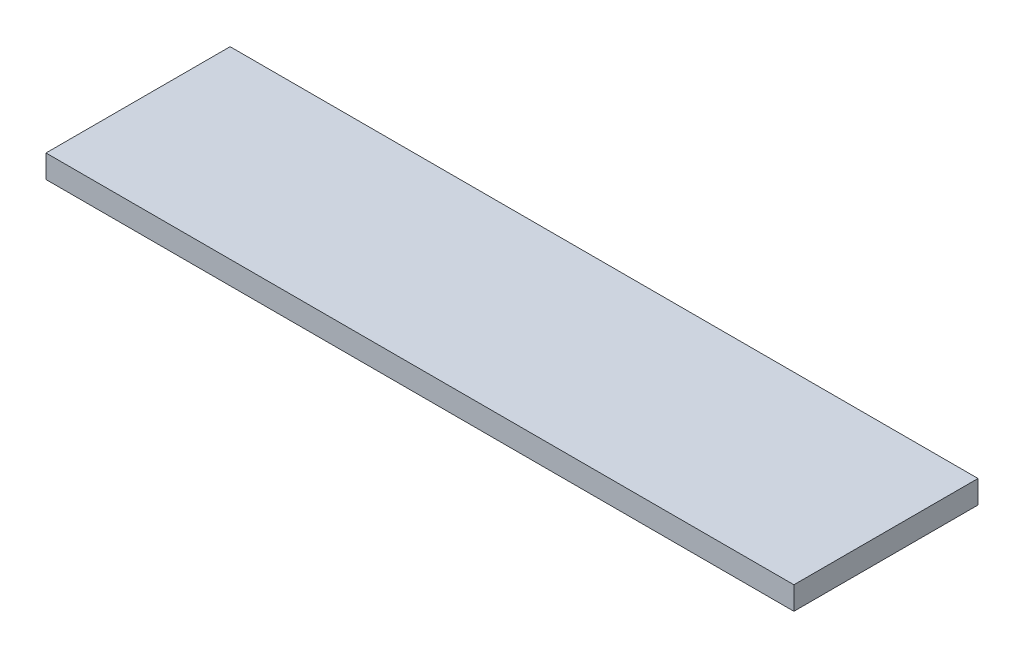
ISO-10303-21;
HEADER;
FILE_DESCRIPTION(('STEP AP214'),'2;1');
FILE_NAME('part.step','',(''),(''),'','','');
FILE_SCHEMA(('AUTOMOTIVE_DESIGN { 1 0 10303 214 1 1 1 1 }'));
ENDSEC;
DATA;
#1=APPLICATION_CONTEXT('core data for automotive mechanical design processes');
#2=APPLICATION_PROTOCOL_DEFINITION('international standard','automotive_design',2000,#1);
#3=PRODUCT_CONTEXT('',#1,'mechanical');
#4=PRODUCT('Part','Part','',(#3));
#5=PRODUCT_RELATED_PRODUCT_CATEGORY('part','',(#4));
#6=PRODUCT_DEFINITION_FORMATION('','',#4);
#7=PRODUCT_DEFINITION_CONTEXT('part definition',#1,'design');
#8=PRODUCT_DEFINITION('design','',#6,#7);
#9=PRODUCT_DEFINITION_SHAPE('','',#8);
#10=(LENGTH_UNIT() NAMED_UNIT(*) SI_UNIT(.MILLI.,.METRE.));
#11=(NAMED_UNIT(*) PLANE_ANGLE_UNIT() SI_UNIT($,.RADIAN.));
#12=(NAMED_UNIT(*) SI_UNIT($,.STERADIAN.) SOLID_ANGLE_UNIT());
#13=UNCERTAINTY_MEASURE_WITH_UNIT(LENGTH_MEASURE(1.E-05),#10,'distance_accuracy_value','');
#14=(GEOMETRIC_REPRESENTATION_CONTEXT(3) GLOBAL_UNCERTAINTY_ASSIGNED_CONTEXT((#13)) GLOBAL_UNIT_ASSIGNED_CONTEXT((#10,
#11,#12)) REPRESENTATION_CONTEXT('',''));
#15=CARTESIAN_POINT('',(0.,0.,0.));
#16=DIRECTION('',(0.,0.,1.));
#17=DIRECTION('',(1.,0.,0.));
#18=AXIS2_PLACEMENT_3D('',#15,#16,#17);
#19=CARTESIAN_POINT('',(0.,1.,0.));
#20=DIRECTION('',(1.,0.,0.));
#21=DIRECTION('',(0.,0.,-1.));
#22=AXIS2_PLACEMENT_3D('',#19,#20,#21);
#23=PLANE('',#22);
#24=DIRECTION('',(0.,0.,1.));
#25=VECTOR('',#24,1.);
#26=CARTESIAN_POINT('',(0.,0.,0.));
#27=LINE('',#26,#25);
#28=CARTESIAN_POINT('',(0.,0.,-8.));
#29=VERTEX_POINT('',#28);
#30=CARTESIAN_POINT('',(0.,0.,0.));
#31=VERTEX_POINT('',#30);
#32=EDGE_CURVE('E96',#29,#31,#27,.T.);
#33=ORIENTED_EDGE('',*,*,#32,.T.);
#34=DIRECTION('',(0.,-1.,0.));
#35=VECTOR('',#34,1.);
#36=CARTESIAN_POINT('',(0.,1.,0.));
#37=LINE('',#36,#35);
#38=CARTESIAN_POINT('',(0.,1.,0.));
#39=VERTEX_POINT('',#38);
#40=EDGE_CURVE('E11',#39,#31,#37,.T.);
#41=ORIENTED_EDGE('',*,*,#40,.F.);
#42=DIRECTION('',(0.,0.,1.));
#43=VECTOR('',#42,1.);
#44=CARTESIAN_POINT('',(0.,1.,0.));
#45=LINE('',#44,#43);
#46=CARTESIAN_POINT('',(0.,1.,-8.));
#47=VERTEX_POINT('',#46);
#48=EDGE_CURVE('E84',#47,#39,#45,.T.);
#49=ORIENTED_EDGE('',*,*,#48,.F.);
#50=DIRECTION('',(0.,-1.,0.));
#51=VECTOR('',#50,1.);
#52=CARTESIAN_POINT('',(0.,1.,-8.));
#53=LINE('',#52,#51);
#54=EDGE_CURVE('E92',#47,#29,#53,.T.);
#55=ORIENTED_EDGE('',*,*,#54,.T.);
#56=EDGE_LOOP('',(#33,#41,#49,#55));
#57=FACE_BOUND('',#56,.T.);
#58=ADVANCED_FACE('F33',(#57),#23,.F.);
#59=CARTESIAN_POINT('',(0.,1.,0.));
#60=DIRECTION('',(0.,0.,-1.));
#61=DIRECTION('',(-1.,0.,0.));
#62=AXIS2_PLACEMENT_3D('',#59,#60,#61);
#63=PLANE('',#62);
#64=DIRECTION('',(1.,0.,0.));
#65=VECTOR('',#64,1.);
#66=CARTESIAN_POINT('',(0.,0.,0.));
#67=LINE('',#66,#65);
#68=CARTESIAN_POINT('',(32.5,0.,0.));
#69=VERTEX_POINT('',#68);
#70=EDGE_CURVE('E88',#31,#69,#67,.T.);
#71=ORIENTED_EDGE('',*,*,#70,.T.);
#72=DIRECTION('',(0.,-1.,0.));
#73=VECTOR('',#72,1.);
#74=CARTESIAN_POINT('',(32.5,1.,0.));
#75=LINE('',#74,#73);
#76=CARTESIAN_POINT('',(32.5,1.,0.));
#77=VERTEX_POINT('',#76);
#78=EDGE_CURVE('E41',#77,#69,#75,.T.);
#79=ORIENTED_EDGE('',*,*,#78,.F.);
#80=DIRECTION('',(1.,0.,0.));
#81=VECTOR('',#80,1.);
#82=CARTESIAN_POINT('',(0.,1.,0.));
#83=LINE('',#82,#81);
#84=EDGE_CURVE('E79',#39,#77,#83,.T.);
#85=ORIENTED_EDGE('',*,*,#84,.F.);
#86=ORIENTED_EDGE('',*,*,#40,.T.);
#87=EDGE_LOOP('',(#71,#79,#85,#86));
#88=FACE_BOUND('',#87,.T.);
#89=ADVANCED_FACE('F87',(#88),#63,.F.);
#90=CARTESIAN_POINT('',(32.5,1.,0.));
#91=DIRECTION('',(-1.,0.,0.));
#92=DIRECTION('',(0.,0.,1.));
#93=AXIS2_PLACEMENT_3D('',#90,#91,#92);
#94=PLANE('',#93);
#95=DIRECTION('',(0.,0.,-1.));
#96=VECTOR('',#95,1.);
#97=CARTESIAN_POINT('',(32.5,0.,0.));
#98=LINE('',#97,#96);
#99=CARTESIAN_POINT('',(32.5,0.,-8.));
#100=VERTEX_POINT('',#99);
#101=EDGE_CURVE('E66',#69,#100,#98,.T.);
#102=ORIENTED_EDGE('',*,*,#101,.T.);
#103=DIRECTION('',(0.,-1.,0.));
#104=VECTOR('',#103,1.);
#105=CARTESIAN_POINT('',(32.5,1.,-8.));
#106=LINE('',#105,#104);
#107=CARTESIAN_POINT('',(32.5,1.,-8.));
#108=VERTEX_POINT('',#107);
#109=EDGE_CURVE('E89',#108,#100,#106,.T.);
#110=ORIENTED_EDGE('',*,*,#109,.F.);
#111=DIRECTION('',(0.,0.,-1.));
#112=VECTOR('',#111,1.);
#113=CARTESIAN_POINT('',(32.5,1.,0.));
#114=LINE('',#113,#112);
#115=EDGE_CURVE('E82',#77,#108,#114,.T.);
#116=ORIENTED_EDGE('',*,*,#115,.F.);
#117=ORIENTED_EDGE('',*,*,#78,.T.);
#118=EDGE_LOOP('',(#102,#110,#116,#117));
#119=FACE_BOUND('',#118,.T.);
#120=ADVANCED_FACE('F90',(#119),#94,.F.);
#121=CARTESIAN_POINT('',(0.,1.,-8.));
#122=DIRECTION('',(0.,0.,1.));
#123=DIRECTION('',(1.,0.,0.));
#124=AXIS2_PLACEMENT_3D('',#121,#122,#123);
#125=PLANE('',#124);
#126=DIRECTION('',(-1.,0.,0.));
#127=VECTOR('',#126,1.);
#128=CARTESIAN_POINT('',(0.,0.,-8.));
#129=LINE('',#128,#127);
#130=EDGE_CURVE('E72',#100,#29,#129,.T.);
#131=ORIENTED_EDGE('',*,*,#130,.T.);
#132=ORIENTED_EDGE('',*,*,#54,.F.);
#133=DIRECTION('',(-1.,0.,0.));
#134=VECTOR('',#133,1.);
#135=CARTESIAN_POINT('',(0.,1.,-8.));
#136=LINE('',#135,#134);
#137=EDGE_CURVE('E49',#108,#47,#136,.T.);
#138=ORIENTED_EDGE('',*,*,#137,.F.);
#139=ORIENTED_EDGE('',*,*,#109,.T.);
#140=EDGE_LOOP('',(#131,#132,#138,#139));
#141=FACE_BOUND('',#140,.T.);
#142=ADVANCED_FACE('F103',(#141),#125,.F.);
#143=CARTESIAN_POINT('',(0.,1.,0.));
#144=DIRECTION('',(0.,-1.,0.));
#145=DIRECTION('',(0.,0.,-1.));
#146=AXIS2_PLACEMENT_3D('',#143,#144,#145);
#147=PLANE('',#146);
#148=ORIENTED_EDGE('',*,*,#48,.T.);
#149=ORIENTED_EDGE('',*,*,#84,.T.);
#150=ORIENTED_EDGE('',*,*,#115,.T.);
#151=ORIENTED_EDGE('',*,*,#137,.T.);
#152=EDGE_LOOP('',(#148,#149,#150,#151));
#153=FACE_BOUND('',#152,.T.);
#154=ADVANCED_FACE('F80',(#153),#147,.F.);
#155=CARTESIAN_POINT('',(0.,0.,0.));
#156=DIRECTION('',(0.,-1.,0.));
#157=DIRECTION('',(0.,0.,-1.));
#158=AXIS2_PLACEMENT_3D('',#155,#156,#157);
#159=PLANE('',#158);
#160=ORIENTED_EDGE('',*,*,#32,.F.);
#161=ORIENTED_EDGE('',*,*,#130,.F.);
#162=ORIENTED_EDGE('',*,*,#101,.F.);
#163=ORIENTED_EDGE('',*,*,#70,.F.);
#164=EDGE_LOOP('',(#160,#161,#162,#163));
#165=FACE_BOUND('',#164,.T.);
#166=ADVANCED_FACE('F106',(#165),#159,.T.);
#167=CLOSED_SHELL('',(#58,#89,#120,#142,#154,#166));
#168=MANIFOLD_SOLID_BREP('B2',#167);
#169=ADVANCED_BREP_SHAPE_REPRESENTATION('',(#18,#168),#14);
#170=SHAPE_DEFINITION_REPRESENTATION(#9,#169);
ENDSEC;
END-ISO-10303-21;
